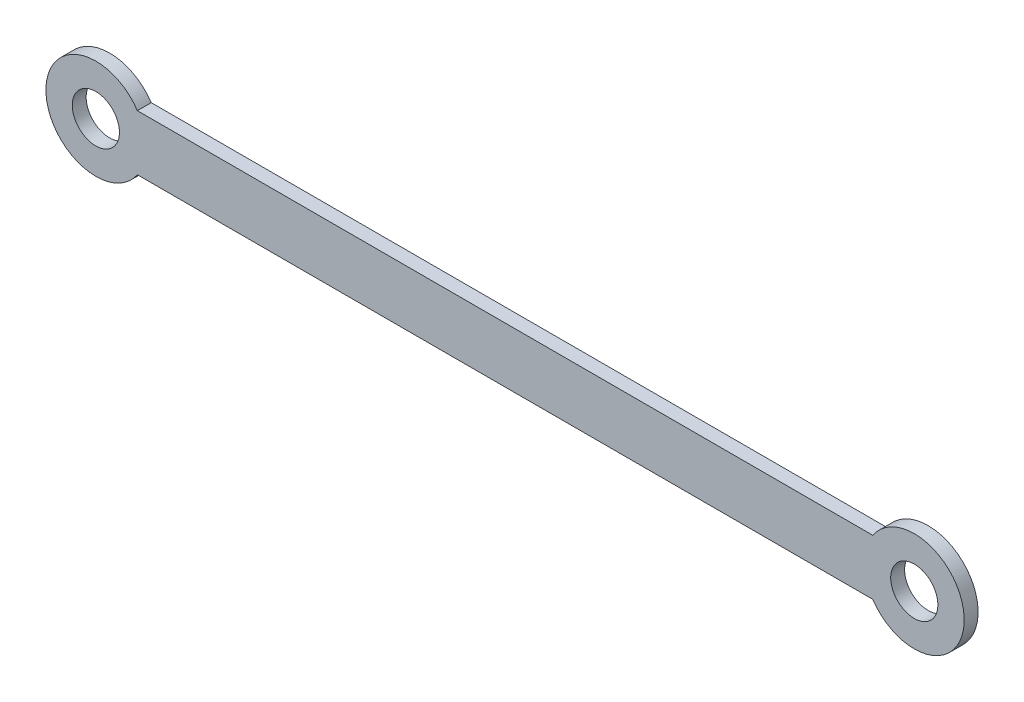
ISO-10303-21;
HEADER;
FILE_DESCRIPTION(('STEP AP214'),'2;1');
FILE_NAME('part.step','',(''),(''),'','','');
FILE_SCHEMA(('AUTOMOTIVE_DESIGN { 1 0 10303 214 1 1 1 1 }'));
ENDSEC;
DATA;
#1=APPLICATION_CONTEXT('core data for automotive mechanical design processes');
#2=APPLICATION_PROTOCOL_DEFINITION('international standard','automotive_design',2000,#1);
#3=PRODUCT_CONTEXT('',#1,'mechanical');
#4=PRODUCT('Part','Part','',(#3));
#5=PRODUCT_RELATED_PRODUCT_CATEGORY('part','',(#4));
#6=PRODUCT_DEFINITION_FORMATION('','',#4);
#7=PRODUCT_DEFINITION_CONTEXT('part definition',#1,'design');
#8=PRODUCT_DEFINITION('design','',#6,#7);
#9=PRODUCT_DEFINITION_SHAPE('','',#8);
#10=(LENGTH_UNIT() NAMED_UNIT(*) SI_UNIT(.MILLI.,.METRE.));
#11=(NAMED_UNIT(*) PLANE_ANGLE_UNIT() SI_UNIT($,.RADIAN.));
#12=(NAMED_UNIT(*) SI_UNIT($,.STERADIAN.) SOLID_ANGLE_UNIT());
#13=UNCERTAINTY_MEASURE_WITH_UNIT(LENGTH_MEASURE(1.E-05),#10,'distance_accuracy_value','');
#14=(GEOMETRIC_REPRESENTATION_CONTEXT(3) GLOBAL_UNCERTAINTY_ASSIGNED_CONTEXT((#13)) GLOBAL_UNIT_ASSIGNED_CONTEXT((#10,
#11,#12)) REPRESENTATION_CONTEXT('',''));
#15=CARTESIAN_POINT('',(0.,0.,0.));
#16=DIRECTION('',(0.,0.,1.));
#17=DIRECTION('',(1.,0.,0.));
#18=AXIS2_PLACEMENT_3D('',#15,#16,#17);
#19=CARTESIAN_POINT('',(0.,0.,2.5));
#20=DIRECTION('',(0.,0.,1.));
#21=DIRECTION('',(1.,0.,0.));
#22=AXIS2_PLACEMENT_3D('',#19,#20,#21);
#23=PLANE('',#22);
#24=CARTESIAN_POINT('',(0.,0.,2.5));
#25=DIRECTION('',(0.,0.,1.));
#26=DIRECTION('',(1.,0.,0.));
#27=AXIS2_PLACEMENT_3D('',#24,#25,#26);
#28=CIRCLE('',#27,4.25);
#29=CARTESIAN_POINT('',(4.25,0.,2.5));
#30=VERTEX_POINT('',#29);
#31=EDGE_CURVE('E103',#30,#30,#28,.T.);
#32=ORIENTED_EDGE('',*,*,#31,.F.);
#33=EDGE_LOOP('',(#32));
#34=FACE_BOUND('',#33,.T.);
#35=CARTESIAN_POINT('',(0.,0.,2.5));
#36=DIRECTION('',(0.,0.,1.));
#37=DIRECTION('',(1.,0.,0.));
#38=AXIS2_PLACEMENT_3D('',#35,#36,#37);
#39=CIRCLE('',#38,9.);
#40=CARTESIAN_POINT('',(7.48331477354788,5.,2.5));
#41=VERTEX_POINT('',#40);
#42=CARTESIAN_POINT('',(7.48331477354788,-5.,2.5));
#43=VERTEX_POINT('',#42);
#44=EDGE_CURVE('E88',#41,#43,#39,.T.);
#45=ORIENTED_EDGE('',*,*,#44,.T.);
#46=DIRECTION('',(1.,0.,0.));
#47=VECTOR('',#46,1.);
#48=CARTESIAN_POINT('',(7.48331477354788,-5.,2.5));
#49=LINE('',#48,#47);
#50=CARTESIAN_POINT('',(140.016685226452,-5.,2.5));
#51=VERTEX_POINT('',#50);
#52=EDGE_CURVE('E83',#43,#51,#49,.T.);
#53=ORIENTED_EDGE('',*,*,#52,.T.);
#54=CARTESIAN_POINT('',(147.5,0.,2.5));
#55=DIRECTION('',(0.,0.,1.));
#56=DIRECTION('',(1.,0.,0.));
#57=AXIS2_PLACEMENT_3D('',#54,#55,#56);
#58=CIRCLE('',#57,9.);
#59=CARTESIAN_POINT('',(140.016685226452,5.,2.5));
#60=VERTEX_POINT('',#59);
#61=EDGE_CURVE('E86',#51,#60,#58,.T.);
#62=ORIENTED_EDGE('',*,*,#61,.T.);
#63=DIRECTION('',(-1.,0.,0.));
#64=VECTOR('',#63,1.);
#65=CARTESIAN_POINT('',(7.48331477354788,5.,2.5));
#66=LINE('',#65,#64);
#67=EDGE_CURVE('E53',#60,#41,#66,.T.);
#68=ORIENTED_EDGE('',*,*,#67,.T.);
#69=EDGE_LOOP('',(#45,#53,#62,#68));
#70=FACE_BOUND('',#69,.T.);
#71=CARTESIAN_POINT('',(147.5,0.,2.5));
#72=DIRECTION('',(0.,0.,1.));
#73=DIRECTION('',(1.,0.,0.));
#74=AXIS2_PLACEMENT_3D('',#71,#72,#73);
#75=CIRCLE('',#74,4.25000000000001);
#76=CARTESIAN_POINT('',(151.75,0.,2.5));
#77=VERTEX_POINT('',#76);
#78=EDGE_CURVE('E118',#77,#77,#75,.T.);
#79=ORIENTED_EDGE('',*,*,#78,.F.);
#80=EDGE_LOOP('',(#79));
#81=FACE_BOUND('',#80,.T.);
#82=ADVANCED_FACE('F36',(#34,#70,#81),#23,.T.);
#83=CARTESIAN_POINT('',(0.,0.,0.));
#84=DIRECTION('',(0.,0.,1.));
#85=DIRECTION('',(1.,0.,0.));
#86=AXIS2_PLACEMENT_3D('',#83,#84,#85);
#87=PLANE('',#86);
#88=CARTESIAN_POINT('',(0.,0.,0.));
#89=DIRECTION('',(0.,0.,1.));
#90=DIRECTION('',(1.,0.,0.));
#91=AXIS2_PLACEMENT_3D('',#88,#89,#90);
#92=CIRCLE('',#91,9.);
#93=CARTESIAN_POINT('',(7.48331477354788,5.,0.));
#94=VERTEX_POINT('',#93);
#95=CARTESIAN_POINT('',(7.48331477354788,-5.,0.));
#96=VERTEX_POINT('',#95);
#97=EDGE_CURVE('E100',#94,#96,#92,.T.);
#98=ORIENTED_EDGE('',*,*,#97,.F.);
#99=DIRECTION('',(-1.,0.,0.));
#100=VECTOR('',#99,1.);
#101=CARTESIAN_POINT('',(7.48331477354788,5.,0.));
#102=LINE('',#101,#100);
#103=CARTESIAN_POINT('',(140.016685226452,5.,0.));
#104=VERTEX_POINT('',#103);
#105=EDGE_CURVE('E76',#104,#94,#102,.T.);
#106=ORIENTED_EDGE('',*,*,#105,.F.);
#107=CARTESIAN_POINT('',(147.5,0.,0.));
#108=DIRECTION('',(0.,0.,1.));
#109=DIRECTION('',(1.,0.,0.));
#110=AXIS2_PLACEMENT_3D('',#107,#108,#109);
#111=CIRCLE('',#110,9.);
#112=CARTESIAN_POINT('',(140.016685226452,-5.,0.));
#113=VERTEX_POINT('',#112);
#114=EDGE_CURVE('E70',#113,#104,#111,.T.);
#115=ORIENTED_EDGE('',*,*,#114,.F.);
#116=DIRECTION('',(1.,0.,0.));
#117=VECTOR('',#116,1.);
#118=CARTESIAN_POINT('',(7.48331477354788,-5.,0.));
#119=LINE('',#118,#117);
#120=EDGE_CURVE('E92',#96,#113,#119,.T.);
#121=ORIENTED_EDGE('',*,*,#120,.F.);
#122=EDGE_LOOP('',(#98,#106,#115,#121));
#123=FACE_BOUND('',#122,.T.);
#124=CARTESIAN_POINT('',(0.,0.,0.));
#125=DIRECTION('',(0.,0.,1.));
#126=DIRECTION('',(1.,0.,0.));
#127=AXIS2_PLACEMENT_3D('',#124,#125,#126);
#128=CIRCLE('',#127,4.25);
#129=CARTESIAN_POINT('',(4.25,0.,0.));
#130=VERTEX_POINT('',#129);
#131=EDGE_CURVE('E115',#130,#130,#128,.T.);
#132=ORIENTED_EDGE('',*,*,#131,.T.);
#133=EDGE_LOOP('',(#132));
#134=FACE_BOUND('',#133,.T.);
#135=CARTESIAN_POINT('',(147.5,0.,0.));
#136=DIRECTION('',(0.,0.,1.));
#137=DIRECTION('',(1.,0.,0.));
#138=AXIS2_PLACEMENT_3D('',#135,#136,#137);
#139=CIRCLE('',#138,4.25000000000001);
#140=CARTESIAN_POINT('',(151.75,0.,0.));
#141=VERTEX_POINT('',#140);
#142=EDGE_CURVE('E121',#141,#141,#139,.T.);
#143=ORIENTED_EDGE('',*,*,#142,.T.);
#144=EDGE_LOOP('',(#143));
#145=FACE_BOUND('',#144,.T.);
#146=ADVANCED_FACE('F111',(#123,#134,#145),#87,.F.);
#147=CARTESIAN_POINT('',(0.,0.,2.5));
#148=DIRECTION('',(0.,0.,-1.));
#149=DIRECTION('',(-1.,0.,0.));
#150=AXIS2_PLACEMENT_3D('',#147,#148,#149);
#151=CYLINDRICAL_SURFACE('',#150,9.);
#152=ORIENTED_EDGE('',*,*,#97,.T.);
#153=DIRECTION('',(0.,0.,-1.));
#154=VECTOR('',#153,1.);
#155=CARTESIAN_POINT('',(7.48331477354788,-5.,2.5));
#156=LINE('',#155,#154);
#157=EDGE_CURVE('E11',#43,#96,#156,.T.);
#158=ORIENTED_EDGE('',*,*,#157,.F.);
#159=ORIENTED_EDGE('',*,*,#44,.F.);
#160=DIRECTION('',(0.,0.,-1.));
#161=VECTOR('',#160,1.);
#162=CARTESIAN_POINT('',(7.48331477354788,5.,2.5));
#163=LINE('',#162,#161);
#164=EDGE_CURVE('E96',#41,#94,#163,.T.);
#165=ORIENTED_EDGE('',*,*,#164,.T.);
#166=EDGE_LOOP('',(#152,#158,#159,#165));
#167=FACE_BOUND('',#166,.T.);
#168=ADVANCED_FACE('F38',(#167),#151,.T.);
#169=CARTESIAN_POINT('',(7.48331477354788,-5.,2.5));
#170=DIRECTION('',(0.,1.,0.));
#171=DIRECTION('',(0.,0.,1.));
#172=AXIS2_PLACEMENT_3D('',#169,#170,#171);
#173=PLANE('',#172);
#174=ORIENTED_EDGE('',*,*,#120,.T.);
#175=DIRECTION('',(0.,0.,-1.));
#176=VECTOR('',#175,1.);
#177=CARTESIAN_POINT('',(140.016685226452,-5.,2.5));
#178=LINE('',#177,#176);
#179=EDGE_CURVE('E45',#51,#113,#178,.T.);
#180=ORIENTED_EDGE('',*,*,#179,.F.);
#181=ORIENTED_EDGE('',*,*,#52,.F.);
#182=ORIENTED_EDGE('',*,*,#157,.T.);
#183=EDGE_LOOP('',(#174,#180,#181,#182));
#184=FACE_BOUND('',#183,.T.);
#185=ADVANCED_FACE('F91',(#184),#173,.F.);
#186=CARTESIAN_POINT('',(147.5,0.,2.5));
#187=DIRECTION('',(0.,0.,-1.));
#188=DIRECTION('',(-1.,0.,0.));
#189=AXIS2_PLACEMENT_3D('',#186,#187,#188);
#190=CYLINDRICAL_SURFACE('',#189,9.);
#191=ORIENTED_EDGE('',*,*,#114,.T.);
#192=DIRECTION('',(0.,0.,-1.));
#193=VECTOR('',#192,1.);
#194=CARTESIAN_POINT('',(140.016685226452,5.,2.5));
#195=LINE('',#194,#193);
#196=EDGE_CURVE('E93',#60,#104,#195,.T.);
#197=ORIENTED_EDGE('',*,*,#196,.F.);
#198=ORIENTED_EDGE('',*,*,#61,.F.);
#199=ORIENTED_EDGE('',*,*,#179,.T.);
#200=EDGE_LOOP('',(#191,#197,#198,#199));
#201=FACE_BOUND('',#200,.T.);
#202=ADVANCED_FACE('F94',(#201),#190,.T.);
#203=CARTESIAN_POINT('',(7.48331477354788,5.,2.5));
#204=DIRECTION('',(0.,-1.,0.));
#205=DIRECTION('',(0.,0.,-1.));
#206=AXIS2_PLACEMENT_3D('',#203,#204,#205);
#207=PLANE('',#206);
#208=ORIENTED_EDGE('',*,*,#105,.T.);
#209=ORIENTED_EDGE('',*,*,#164,.F.);
#210=ORIENTED_EDGE('',*,*,#67,.F.);
#211=ORIENTED_EDGE('',*,*,#196,.T.);
#212=EDGE_LOOP('',(#208,#209,#210,#211));
#213=FACE_BOUND('',#212,.T.);
#214=ADVANCED_FACE('F108',(#213),#207,.F.);
#215=CARTESIAN_POINT('',(0.,0.,2.5));
#216=DIRECTION('',(0.,0.,-1.));
#217=DIRECTION('',(-1.,0.,0.));
#218=AXIS2_PLACEMENT_3D('',#215,#216,#217);
#219=CYLINDRICAL_SURFACE('',#218,4.25);
#220=ORIENTED_EDGE('',*,*,#31,.T.);
#221=EDGE_LOOP('',(#220));
#222=FACE_BOUND('',#221,.T.);
#223=ORIENTED_EDGE('',*,*,#131,.F.);
#224=EDGE_LOOP('',(#223));
#225=FACE_BOUND('',#224,.T.);
#226=ADVANCED_FACE('F138',(#222,#225),#219,.F.);
#227=CARTESIAN_POINT('',(147.5,0.,2.5));
#228=DIRECTION('',(0.,0.,-1.));
#229=DIRECTION('',(-1.,0.,0.));
#230=AXIS2_PLACEMENT_3D('',#227,#228,#229);
#231=CYLINDRICAL_SURFACE('',#230,4.25000000000001);
#232=ORIENTED_EDGE('',*,*,#78,.T.);
#233=EDGE_LOOP('',(#232));
#234=FACE_BOUND('',#233,.T.);
#235=ORIENTED_EDGE('',*,*,#142,.F.);
#236=EDGE_LOOP('',(#235));
#237=FACE_BOUND('',#236,.T.);
#238=ADVANCED_FACE('F127',(#234,#237),#231,.F.);
#239=CLOSED_SHELL('',(#82,#146,#168,#185,#202,#214,#226,#238));
#240=MANIFOLD_SOLID_BREP('B2',#239);
#241=ADVANCED_BREP_SHAPE_REPRESENTATION('',(#18,#240),#14);
#242=SHAPE_DEFINITION_REPRESENTATION(#9,#241);
ENDSEC;
END-ISO-10303-21;
